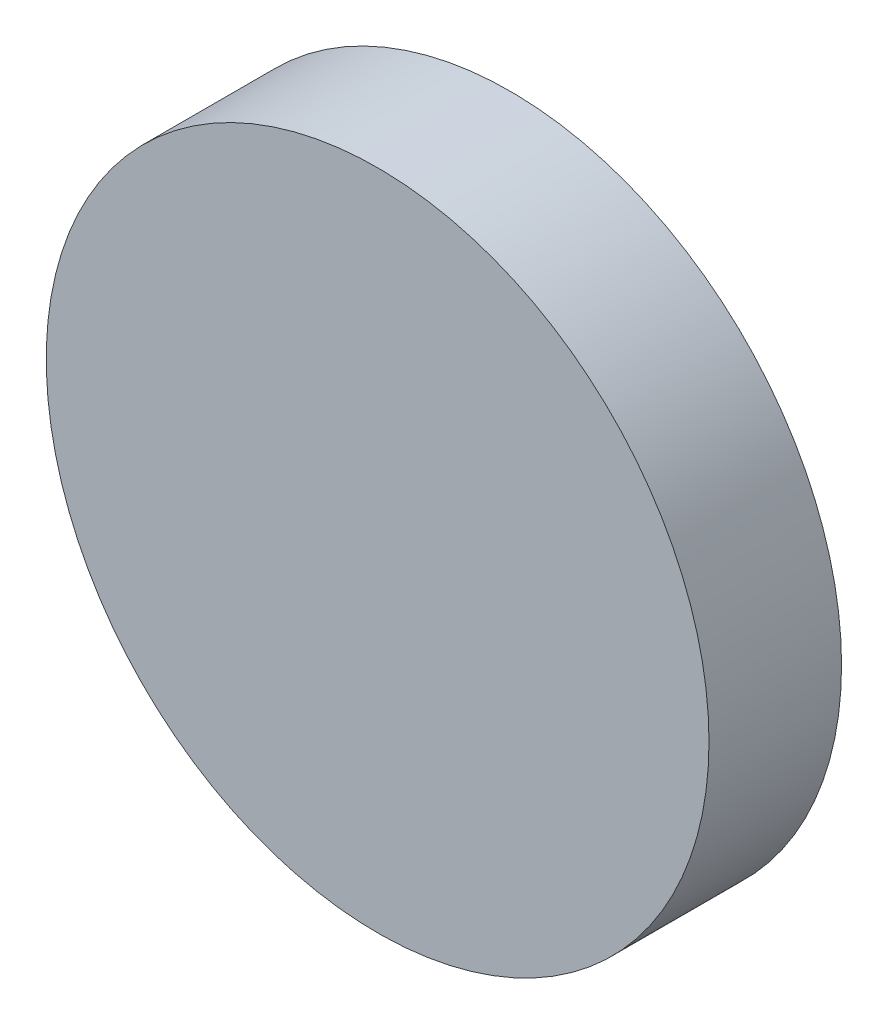
ISO-10303-21;
HEADER;
FILE_DESCRIPTION(('STEP AP214'),'2;1');
FILE_NAME('part.step','',(''),(''),'','','');
FILE_SCHEMA(('AUTOMOTIVE_DESIGN { 1 0 10303 214 1 1 1 1 }'));
ENDSEC;
DATA;
#1=APPLICATION_CONTEXT('core data for automotive mechanical design processes');
#2=APPLICATION_PROTOCOL_DEFINITION('international standard','automotive_design',2000,#1);
#3=PRODUCT_CONTEXT('',#1,'mechanical');
#4=PRODUCT('Part','Part','',(#3));
#5=PRODUCT_RELATED_PRODUCT_CATEGORY('part','',(#4));
#6=PRODUCT_DEFINITION_FORMATION('','',#4);
#7=PRODUCT_DEFINITION_CONTEXT('part definition',#1,'design');
#8=PRODUCT_DEFINITION('design','',#6,#7);
#9=PRODUCT_DEFINITION_SHAPE('','',#8);
#10=(LENGTH_UNIT() NAMED_UNIT(*) SI_UNIT(.MILLI.,.METRE.));
#11=(NAMED_UNIT(*) PLANE_ANGLE_UNIT() SI_UNIT($,.RADIAN.));
#12=(NAMED_UNIT(*) SI_UNIT($,.STERADIAN.) SOLID_ANGLE_UNIT());
#13=UNCERTAINTY_MEASURE_WITH_UNIT(LENGTH_MEASURE(1.E-05),#10,'distance_accuracy_value','');
#14=(GEOMETRIC_REPRESENTATION_CONTEXT(3) GLOBAL_UNCERTAINTY_ASSIGNED_CONTEXT((#13)) GLOBAL_UNIT_ASSIGNED_CONTEXT((#10,
#11,#12)) REPRESENTATION_CONTEXT('',''));
#15=CARTESIAN_POINT('',(0.,0.,0.));
#16=DIRECTION('',(0.,0.,1.));
#17=DIRECTION('',(1.,0.,0.));
#18=AXIS2_PLACEMENT_3D('',#15,#16,#17);
#19=CARTESIAN_POINT('',(0.,0.,40.));
#20=DIRECTION('',(0.,0.,-1.));
#21=DIRECTION('',(-1.,0.,0.));
#22=AXIS2_PLACEMENT_3D('',#19,#20,#21);
#23=CYLINDRICAL_SURFACE('',#22,100.);
#24=CARTESIAN_POINT('',(0.,0.,40.));
#25=DIRECTION('',(0.,0.,1.));
#26=DIRECTION('',(1.,0.,0.));
#27=AXIS2_PLACEMENT_3D('',#24,#25,#26);
#28=CIRCLE('',#27,100.);
#29=CARTESIAN_POINT('',(100.,0.,40.));
#30=VERTEX_POINT('',#29);
#31=EDGE_CURVE('E10',#30,#30,#28,.T.);
#32=ORIENTED_EDGE('',*,*,#31,.F.);
#33=EDGE_LOOP('',(#32));
#34=FACE_BOUND('',#33,.T.);
#35=CARTESIAN_POINT('',(0.,0.,0.));
#36=DIRECTION('',(0.,0.,1.));
#37=DIRECTION('',(1.,0.,0.));
#38=AXIS2_PLACEMENT_3D('',#35,#36,#37);
#39=CIRCLE('',#38,100.);
#40=CARTESIAN_POINT('',(100.,0.,0.));
#41=VERTEX_POINT('',#40);
#42=EDGE_CURVE('E46',#41,#41,#39,.T.);
#43=ORIENTED_EDGE('',*,*,#42,.T.);
#44=EDGE_LOOP('',(#43));
#45=FACE_BOUND('',#44,.T.);
#46=ADVANCED_FACE('F43',(#34,#45),#23,.T.);
#47=CARTESIAN_POINT('',(0.,0.,40.));
#48=DIRECTION('',(0.,0.,1.));
#49=DIRECTION('',(1.,0.,0.));
#50=AXIS2_PLACEMENT_3D('',#47,#48,#49);
#51=PLANE('',#50);
#52=ORIENTED_EDGE('',*,*,#31,.T.);
#53=EDGE_LOOP('',(#52));
#54=FACE_BOUND('',#53,.T.);
#55=ADVANCED_FACE('F60',(#54),#51,.T.);
#56=CARTESIAN_POINT('',(0.,0.,0.));
#57=DIRECTION('',(0.,0.,1.));
#58=DIRECTION('',(1.,0.,0.));
#59=AXIS2_PLACEMENT_3D('',#56,#57,#58);
#60=PLANE('',#59);
#61=ORIENTED_EDGE('',*,*,#42,.F.);
#62=EDGE_LOOP('',(#61));
#63=FACE_BOUND('',#62,.T.);
#64=ADVANCED_FACE('F58',(#63),#60,.F.);
#65=CLOSED_SHELL('',(#46,#55,#64));
#66=MANIFOLD_SOLID_BREP('B2',#65);
#67=ADVANCED_BREP_SHAPE_REPRESENTATION('',(#18,#66),#14);
#68=SHAPE_DEFINITION_REPRESENTATION(#9,#67);
ENDSEC;
END-ISO-10303-21;
